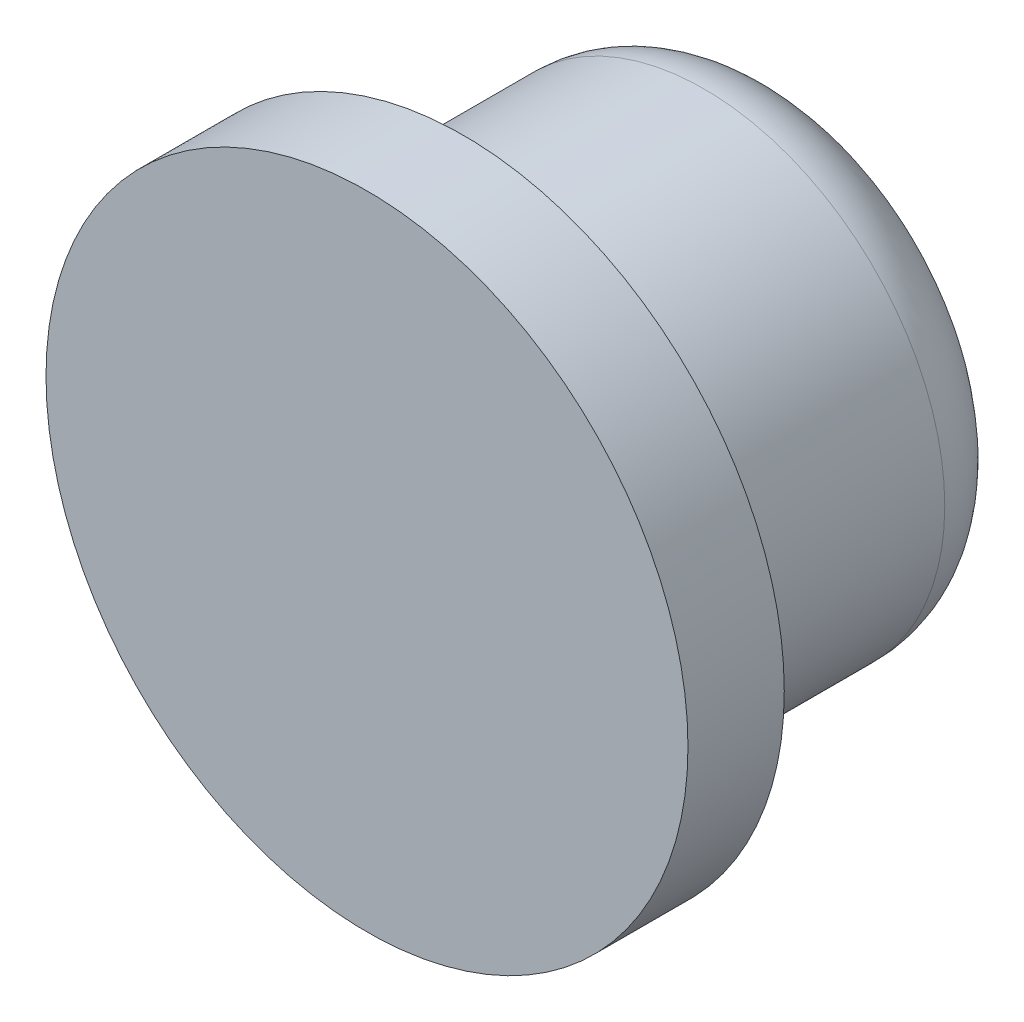
ISO-10303-21;
HEADER;
FILE_DESCRIPTION(('STEP AP214'),'2;1');
FILE_NAME('part.step','',(''),(''),'','','');
FILE_SCHEMA(('AUTOMOTIVE_DESIGN { 1 0 10303 214 1 1 1 1 }'));
ENDSEC;
DATA;
#1=APPLICATION_CONTEXT('core data for automotive mechanical design processes');
#2=APPLICATION_PROTOCOL_DEFINITION('international standard','automotive_design',2000,#1);
#3=PRODUCT_CONTEXT('',#1,'mechanical');
#4=PRODUCT('Part','Part','',(#3));
#5=PRODUCT_RELATED_PRODUCT_CATEGORY('part','',(#4));
#6=PRODUCT_DEFINITION_FORMATION('','',#4);
#7=PRODUCT_DEFINITION_CONTEXT('part definition',#1,'design');
#8=PRODUCT_DEFINITION('design','',#6,#7);
#9=PRODUCT_DEFINITION_SHAPE('','',#8);
#10=(LENGTH_UNIT() NAMED_UNIT(*) SI_UNIT(.MILLI.,.METRE.));
#11=(NAMED_UNIT(*) PLANE_ANGLE_UNIT() SI_UNIT($,.RADIAN.));
#12=(NAMED_UNIT(*) SI_UNIT($,.STERADIAN.) SOLID_ANGLE_UNIT());
#13=UNCERTAINTY_MEASURE_WITH_UNIT(LENGTH_MEASURE(1.E-05),#10,'distance_accuracy_value','');
#14=(GEOMETRIC_REPRESENTATION_CONTEXT(3) GLOBAL_UNCERTAINTY_ASSIGNED_CONTEXT((#13)) GLOBAL_UNIT_ASSIGNED_CONTEXT((#10,
#11,#12)) REPRESENTATION_CONTEXT('',''));
#15=CARTESIAN_POINT('',(0.,0.,0.));
#16=DIRECTION('',(0.,0.,1.));
#17=DIRECTION('',(1.,0.,0.));
#18=AXIS2_PLACEMENT_3D('',#15,#16,#17);
#19=CARTESIAN_POINT('',(-13.9897936710418,22.2674502186936,3.));
#20=DIRECTION('',(0.,0.,-1.));
#21=DIRECTION('',(-1.,0.,0.));
#22=AXIS2_PLACEMENT_3D('',#19,#20,#21);
#23=CYLINDRICAL_SURFACE('',#22,10.);
#24=CARTESIAN_POINT('',(-13.9897936710418,22.2674502186936,3.));
#25=DIRECTION('',(0.,0.,1.));
#26=DIRECTION('',(1.,0.,0.));
#27=AXIS2_PLACEMENT_3D('',#24,#25,#26);
#28=CIRCLE('',#27,10.);
#29=CARTESIAN_POINT('',(-3.98979367104177,22.2674502186936,3.));
#30=VERTEX_POINT('',#29);
#31=EDGE_CURVE('E52',#30,#30,#28,.T.);
#32=ORIENTED_EDGE('',*,*,#31,.F.);
#33=EDGE_LOOP('',(#32));
#34=FACE_BOUND('',#33,.T.);
#35=CARTESIAN_POINT('',(-13.9897936710418,22.2674502186936,0.));
#36=DIRECTION('',(0.,0.,1.));
#37=DIRECTION('',(1.,0.,0.));
#38=AXIS2_PLACEMENT_3D('',#35,#36,#37);
#39=CIRCLE('',#38,10.);
#40=CARTESIAN_POINT('',(-3.98979367104177,22.2674502186936,0.));
#41=VERTEX_POINT('',#40);
#42=EDGE_CURVE('E55',#41,#41,#39,.T.);
#43=ORIENTED_EDGE('',*,*,#42,.T.);
#44=EDGE_LOOP('',(#43));
#45=FACE_BOUND('',#44,.T.);
#46=ADVANCED_FACE('F37',(#34,#45),#23,.T.);
#47=CARTESIAN_POINT('',(-13.9897936710418,22.2674502186936,3.));
#48=DIRECTION('',(0.,0.,1.));
#49=DIRECTION('',(1.,0.,0.));
#50=AXIS2_PLACEMENT_3D('',#47,#48,#49);
#51=PLANE('',#50);
#52=ORIENTED_EDGE('',*,*,#31,.T.);
#53=EDGE_LOOP('',(#52));
#54=FACE_BOUND('',#53,.T.);
#55=ADVANCED_FACE('F61',(#54),#51,.T.);
#56=CARTESIAN_POINT('',(-13.9897936710418,22.2674502186936,0.));
#57=DIRECTION('',(0.,0.,1.));
#58=DIRECTION('',(1.,0.,0.));
#59=AXIS2_PLACEMENT_3D('',#56,#57,#58);
#60=PLANE('',#59);
#61=CARTESIAN_POINT('',(-13.9897936710418,22.2674502186936,0.));
#62=DIRECTION('',(0.,0.,-1.));
#63=DIRECTION('',(-1.,0.,0.));
#64=AXIS2_PLACEMENT_3D('',#61,#62,#63);
#65=CIRCLE('',#64,7.5);
#66=CARTESIAN_POINT('',(-21.4897936710418,22.2674502186936,0.));
#67=VERTEX_POINT('',#66);
#68=EDGE_CURVE('E48',#67,#67,#65,.T.);
#69=ORIENTED_EDGE('',*,*,#68,.F.);
#70=EDGE_LOOP('',(#69));
#71=FACE_BOUND('',#70,.T.);
#72=ORIENTED_EDGE('',*,*,#42,.F.);
#73=EDGE_LOOP('',(#72));
#74=FACE_BOUND('',#73,.T.);
#75=ADVANCED_FACE('F67',(#71,#74),#60,.F.);
#76=CARTESIAN_POINT('',(-13.9897936710418,22.2674502186936,-10.));
#77=DIRECTION('',(0.,0.,1.));
#78=DIRECTION('',(1.,0.,0.));
#79=AXIS2_PLACEMENT_3D('',#76,#77,#78);
#80=CYLINDRICAL_SURFACE('',#79,7.5);
#81=CARTESIAN_POINT('',(-13.9897936710418,22.2674502186936,-7.5));
#82=DIRECTION('',(0.,0.,-1.));
#83=DIRECTION('',(-1.,0.,0.));
#84=AXIS2_PLACEMENT_3D('',#81,#82,#83);
#85=CIRCLE('',#84,7.5);
#86=CARTESIAN_POINT('',(-21.4897936710418,22.2674502186936,-7.5));
#87=VERTEX_POINT('',#86);
#88=EDGE_CURVE('E10',#87,#87,#85,.F.);
#89=ORIENTED_EDGE('',*,*,#88,.T.);
#90=EDGE_LOOP('',(#89));
#91=FACE_BOUND('',#90,.T.);
#92=ORIENTED_EDGE('',*,*,#68,.T.);
#93=EDGE_LOOP('',(#92));
#94=FACE_BOUND('',#93,.T.);
#95=ADVANCED_FACE('F69',(#91,#94),#80,.T.);
#96=CARTESIAN_POINT('',(0.,0.,-10.));
#97=DIRECTION('',(0.,0.,-1.));
#98=DIRECTION('',(-1.,0.,0.));
#99=AXIS2_PLACEMENT_3D('',#96,#97,#98);
#100=PLANE('',#99);
#101=CARTESIAN_POINT('',(-13.9897936710418,22.2674502186936,-10.));
#102=DIRECTION('',(0.,0.,-1.));
#103=DIRECTION('',(-1.,0.,0.));
#104=AXIS2_PLACEMENT_3D('',#101,#102,#103);
#105=CIRCLE('',#104,5.);
#106=CARTESIAN_POINT('',(-18.9897936710418,22.2674502186936,-10.));
#107=VERTEX_POINT('',#106);
#108=EDGE_CURVE('E44',#107,#107,#105,.T.);
#109=ORIENTED_EDGE('',*,*,#108,.T.);
#110=EDGE_LOOP('',(#109));
#111=FACE_BOUND('',#110,.T.);
#112=ADVANCED_FACE('F76',(#111),#100,.T.);
#113=CARTESIAN_POINT('',(-13.9897936710418,22.2674502186936,-7.5));
#114=DIRECTION('',(0.,0.,-1.));
#115=DIRECTION('',(-1.,0.,0.));
#116=AXIS2_PLACEMENT_3D('',#113,#114,#115);
#117=TOROIDAL_SURFACE('',#116,5.,2.5);
#118=ORIENTED_EDGE('',*,*,#88,.F.);
#119=EDGE_LOOP('',(#118));
#120=FACE_BOUND('',#119,.T.);
#121=ORIENTED_EDGE('',*,*,#108,.F.);
#122=EDGE_LOOP('',(#121));
#123=FACE_BOUND('',#122,.T.);
#124=ADVANCED_FACE('F39',(#120,#123),#117,.T.);
#125=CLOSED_SHELL('',(#46,#55,#75,#95,#112,#124));
#126=MANIFOLD_SOLID_BREP('B2',#125);
#127=ADVANCED_BREP_SHAPE_REPRESENTATION('',(#18,#126),#14);
#128=SHAPE_DEFINITION_REPRESENTATION(#9,#127);
ENDSEC;
END-ISO-10303-21;
